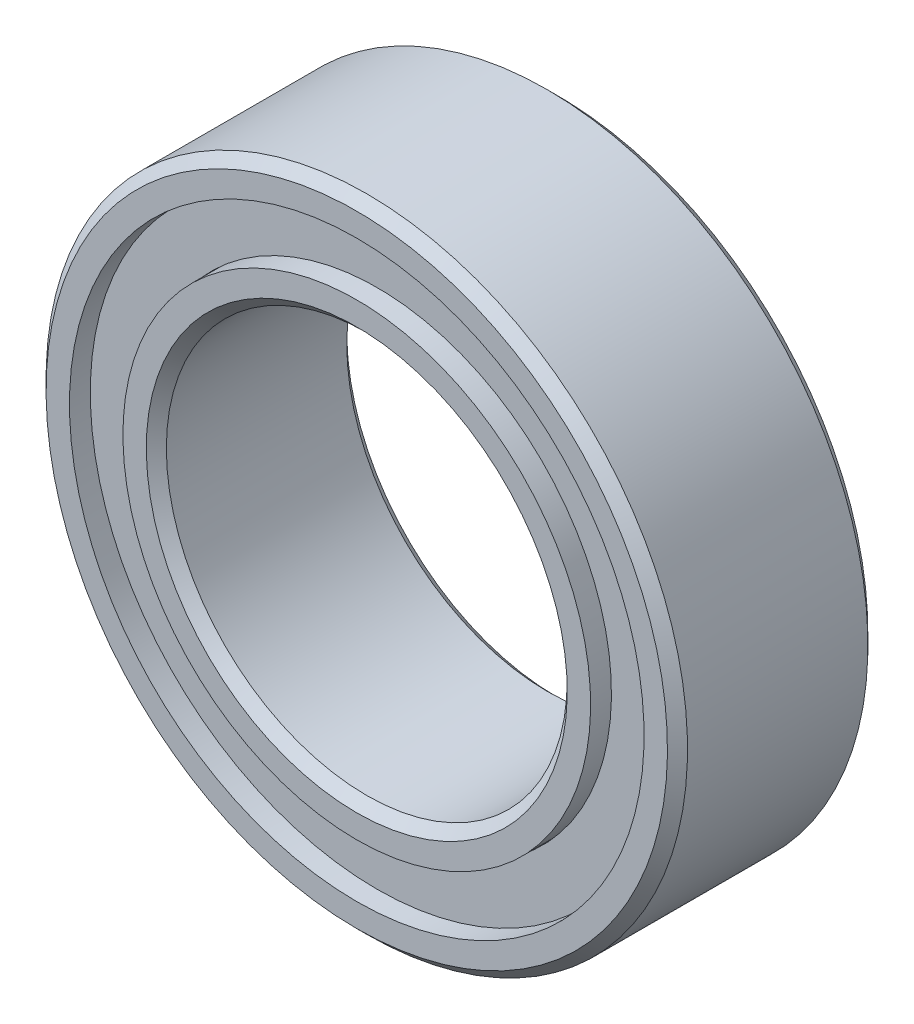
ISO-10303-21;
HEADER;
FILE_DESCRIPTION(('STEP AP214'),'2;1');
FILE_NAME('part.step','',(''),(''),'','','');
FILE_SCHEMA(('AUTOMOTIVE_DESIGN { 1 0 10303 214 1 1 1 1 }'));
ENDSEC;
DATA;
#1=APPLICATION_CONTEXT('core data for automotive mechanical design processes');
#2=APPLICATION_PROTOCOL_DEFINITION('international standard','automotive_design',2000,#1);
#3=PRODUCT_CONTEXT('',#1,'mechanical');
#4=PRODUCT('Part','Part','',(#3));
#5=PRODUCT_RELATED_PRODUCT_CATEGORY('part','',(#4));
#6=PRODUCT_DEFINITION_FORMATION('','',#4);
#7=PRODUCT_DEFINITION_CONTEXT('part definition',#1,'design');
#8=PRODUCT_DEFINITION('design','',#6,#7);
#9=PRODUCT_DEFINITION_SHAPE('','',#8);
#10=(LENGTH_UNIT() NAMED_UNIT(*) SI_UNIT(.MILLI.,.METRE.));
#11=(NAMED_UNIT(*) PLANE_ANGLE_UNIT() SI_UNIT($,.RADIAN.));
#12=(NAMED_UNIT(*) SI_UNIT($,.STERADIAN.) SOLID_ANGLE_UNIT());
#13=UNCERTAINTY_MEASURE_WITH_UNIT(LENGTH_MEASURE(1.E-05),#10,'distance_accuracy_value','');
#14=(GEOMETRIC_REPRESENTATION_CONTEXT(3) GLOBAL_UNCERTAINTY_ASSIGNED_CONTEXT((#13)) GLOBAL_UNIT_ASSIGNED_CONTEXT((#10,
#11,#12)) REPRESENTATION_CONTEXT('',''));
#15=CARTESIAN_POINT('',(0.,0.,0.));
#16=DIRECTION('',(0.,0.,1.));
#17=DIRECTION('',(1.,0.,0.));
#18=AXIS2_PLACEMENT_3D('',#15,#16,#17);
#19=CARTESIAN_POINT('',(6.04140123656884,11.5109283334918,0.));
#20=DIRECTION('',(0.,0.,1.));
#21=DIRECTION('',(0.464723172043757,0.885456025653216,0.));
#22=AXIS2_PLACEMENT_3D('',#19,#20,#21);
#23=SPHERICAL_SURFACE('',#22,2.5915341754868);
#24=CARTESIAN_POINT('',(6.04140123656884,11.5109283334918,2.5915341754868));
#25=VERTEX_POINT('',#24);
#26=VERTEX_LOOP('',#25);
#27=FACE_BOUND('',#26,.T.);
#28=ADVANCED_FACE('F52',(#27),#23,.T.);
#29=CLOSED_SHELL('',(#28));
#30=MANIFOLD_SOLID_BREP('B2',#29);
#31=CARTESIAN_POINT('',(10.6987902566174,7.38484170750515,0.));
#32=DIRECTION('',(0.,0.,1.));
#33=DIRECTION('',(0.822983865893649,0.568064746731166,0.));
#34=AXIS2_PLACEMENT_3D('',#31,#32,#33);
#35=SPHERICAL_SURFACE('',#34,2.5915341754868);
#36=CARTESIAN_POINT('',(10.6987902566174,7.38484170750515,2.5915341754868));
#37=VERTEX_POINT('',#36);
#38=VERTEX_LOOP('',#37);
#39=FACE_BOUND('',#38,.T.);
#40=ADVANCED_FACE('F75',(#39),#35,.T.);
#41=CLOSED_SHELL('',(#40));
#42=MANIFOLD_SOLID_BREP('B6',#41);
#43=CARTESIAN_POINT('',(12.9052153632747,1.56697684331934,0.));
#44=DIRECTION('',(0.,0.,1.));
#45=DIRECTION('',(0.992708874098053,0.120536680255334,0.));
#46=AXIS2_PLACEMENT_3D('',#43,#44,#45);
#47=SPHERICAL_SURFACE('',#46,2.5915341754868);
#48=CARTESIAN_POINT('',(12.9052153632747,1.56697684331934,2.5915341754868));
#49=VERTEX_POINT('',#48);
#50=VERTEX_LOOP('',#49);
#51=FACE_BOUND('',#50,.T.);
#52=ADVANCED_FACE('F95',(#51),#47,.T.);
#53=CLOSED_SHELL('',(#52));
#54=MANIFOLD_SOLID_BREP('B48',#53);
#55=CARTESIAN_POINT('',(12.1552111549104,-4.60986353155285,0.));
#56=DIRECTION('',(0.,0.,1.));
#57=DIRECTION('',(0.935016242685418,-0.354604887042527,0.));
#58=AXIS2_PLACEMENT_3D('',#55,#56,#57);
#59=SPHERICAL_SURFACE('',#58,2.5915341754868);
#60=CARTESIAN_POINT('',(12.1552111549104,-4.60986353155285,2.5915341754868));
#61=VERTEX_POINT('',#60);
#62=VERTEX_LOOP('',#61);
#63=FACE_BOUND('',#62,.T.);
#64=ADVANCED_FACE('F115',(#63),#59,.T.);
#65=CLOSED_SHELL('',(#64));
#66=MANIFOLD_SOLID_BREP('B71',#65);
#67=CARTESIAN_POINT('',(8.62059455713042,-9.73063972622424,0.));
#68=DIRECTION('',(0.,0.,1.));
#69=DIRECTION('',(0.663122658240802,-0.748510748171095,0.));
#70=AXIS2_PLACEMENT_3D('',#67,#68,#69);
#71=SPHERICAL_SURFACE('',#70,2.5915341754868);
#72=CARTESIAN_POINT('',(8.62059455713042,-9.73063972622424,2.5915341754868));
#73=VERTEX_POINT('',#72);
#74=VERTEX_LOOP('',#73);
#75=FACE_BOUND('',#74,.T.);
#76=ADVANCED_FACE('F136',(#75),#71,.T.);
#77=CLOSED_SHELL('',(#76));
#78=MANIFOLD_SOLID_BREP('B91',#77);
#79=CARTESIAN_POINT('',(3.11110363573835,-12.6222436265387,0.));
#80=DIRECTION('',(0.,0.,1.));
#81=DIRECTION('',(0.239315664287565,-0.97094181742605,0.));
#82=AXIS2_PLACEMENT_3D('',#79,#80,#81);
#83=SPHERICAL_SURFACE('',#82,2.5915341754868);
#84=CARTESIAN_POINT('',(3.11110363573835,-12.6222436265387,2.5915341754868));
#85=VERTEX_POINT('',#84);
#86=VERTEX_LOOP('',#85);
#87=FACE_BOUND('',#86,.T.);
#88=ADVANCED_FACE('F159',(#87),#83,.T.);
#89=CLOSED_SHELL('',(#88));
#90=MANIFOLD_SOLID_BREP('B111',#89);
#91=CARTESIAN_POINT('',(-3.11110363573817,-12.6222436265387,0.));
#92=DIRECTION('',(0.,0.,1.));
#93=DIRECTION('',(-0.239315664287552,-0.970941817426054,0.));
#94=AXIS2_PLACEMENT_3D('',#91,#92,#93);
#95=SPHERICAL_SURFACE('',#94,2.5915341754868);
#96=CARTESIAN_POINT('',(-3.11110363573817,-12.6222436265387,2.5915341754868));
#97=VERTEX_POINT('',#96);
#98=VERTEX_LOOP('',#97);
#99=FACE_BOUND('',#98,.T.);
#100=ADVANCED_FACE('F179',(#99),#95,.T.);
#101=CLOSED_SHELL('',(#100));
#102=MANIFOLD_SOLID_BREP('B132',#101);
#103=CARTESIAN_POINT('',(-8.62059455713028,-9.73063972622436,0.));
#104=DIRECTION('',(0.,0.,1.));
#105=DIRECTION('',(-0.663122658240791,-0.748510748171105,0.));
#106=AXIS2_PLACEMENT_3D('',#103,#104,#105);
#107=SPHERICAL_SURFACE('',#106,2.5915341754868);
#108=CARTESIAN_POINT('',(-8.62059455713028,-9.73063972622436,2.5915341754868));
#109=VERTEX_POINT('',#108);
#110=VERTEX_LOOP('',#109);
#111=FACE_BOUND('',#110,.T.);
#112=ADVANCED_FACE('F199',(#111),#107,.T.);
#113=CLOSED_SHELL('',(#112));
#114=MANIFOLD_SOLID_BREP('B155',#113);
#115=CARTESIAN_POINT('',(-12.1552111549104,-4.60986353155301,0.));
#116=DIRECTION('',(0.,0.,1.));
#117=DIRECTION('',(-0.935016242685413,-0.35460488704254,0.));
#118=AXIS2_PLACEMENT_3D('',#115,#116,#117);
#119=SPHERICAL_SURFACE('',#118,2.5915341754868);
#120=CARTESIAN_POINT('',(-12.1552111549104,-4.60986353155301,2.5915341754868));
#121=VERTEX_POINT('',#120);
#122=VERTEX_LOOP('',#121);
#123=FACE_BOUND('',#122,.T.);
#124=ADVANCED_FACE('F219',(#123),#119,.T.);
#125=CLOSED_SHELL('',(#124));
#126=MANIFOLD_SOLID_BREP('B175',#125);
#127=CARTESIAN_POINT('',(-12.9052153632747,1.56697684331916,0.));
#128=DIRECTION('',(0.,0.,1.));
#129=DIRECTION('',(-0.992708874098054,0.12053668025532,0.));
#130=AXIS2_PLACEMENT_3D('',#127,#128,#129);
#131=SPHERICAL_SURFACE('',#130,2.5915341754868);
#132=CARTESIAN_POINT('',(-12.9052153632747,1.56697684331916,2.5915341754868));
#133=VERTEX_POINT('',#132);
#134=VERTEX_LOOP('',#133);
#135=FACE_BOUND('',#134,.T.);
#136=ADVANCED_FACE('F239',(#135),#131,.T.);
#137=CLOSED_SHELL('',(#136));
#138=MANIFOLD_SOLID_BREP('B195',#137);
#139=CARTESIAN_POINT('',(-10.6987902566175,7.384841707505,0.));
#140=DIRECTION('',(0.,0.,1.));
#141=DIRECTION('',(-0.822983865893658,0.568064746731154,0.));
#142=AXIS2_PLACEMENT_3D('',#139,#140,#141);
#143=SPHERICAL_SURFACE('',#142,2.5915341754868);
#144=CARTESIAN_POINT('',(-10.6987902566175,7.384841707505,2.5915341754868));
#145=VERTEX_POINT('',#144);
#146=VERTEX_LOOP('',#145);
#147=FACE_BOUND('',#146,.T.);
#148=ADVANCED_FACE('F259',(#147),#143,.T.);
#149=CLOSED_SHELL('',(#148));
#150=MANIFOLD_SOLID_BREP('B215',#149);
#151=CARTESIAN_POINT('',(-6.041401236569,11.5109283334917,0.));
#152=DIRECTION('',(0.,0.,1.));
#153=DIRECTION('',(-0.46472317204377,0.885456025653209,0.));
#154=AXIS2_PLACEMENT_3D('',#151,#152,#153);
#155=SPHERICAL_SURFACE('',#154,2.5915341754868);
#156=CARTESIAN_POINT('',(-6.041401236569,11.5109283334917,2.5915341754868));
#157=VERTEX_POINT('',#156);
#158=VERTEX_LOOP('',#157);
#159=FACE_BOUND('',#158,.T.);
#160=ADVANCED_FACE('F280',(#159),#155,.T.);
#161=CLOSED_SHELL('',(#160));
#162=MANIFOLD_SOLID_BREP('B235',#161);
#163=CARTESIAN_POINT('',(0.,13.,0.));
#164=DIRECTION('',(0.,0.,1.));
#165=DIRECTION('',(0.,1.,0.));
#166=AXIS2_PLACEMENT_3D('',#163,#164,#165);
#167=SPHERICAL_SURFACE('',#166,2.5915341754868);
#168=CARTESIAN_POINT('',(0.,13.,2.5915341754868));
#169=VERTEX_POINT('',#168);
#170=VERTEX_LOOP('',#169);
#171=FACE_BOUND('',#170,.T.);
#172=ADVANCED_FACE('F307',(#171),#167,.T.);
#173=CLOSED_SHELL('',(#172));
#174=MANIFOLD_SOLID_BREP('B255',#173);
#175=CARTESIAN_POINT('',(0.,11.6666666666667,5.00000000000002));
#176=DIRECTION('',(0.,0.,-1.));
#177=DIRECTION('',(0.,1.,0.));
#178=AXIS2_PLACEMENT_3D('',#175,#176,#177);
#179=PLANE('',#178);
#180=CARTESIAN_POINT('',(0.,0.,5.00000000000002));
#181=DIRECTION('',(0.,0.,1.));
#182=DIRECTION('',(0.,-1.,0.));
#183=AXIS2_PLACEMENT_3D('',#180,#181,#182);
#184=CIRCLE('',#183,10.5);
#185=CARTESIAN_POINT('',(0.,-10.5,5.00000000000002));
#186=VERTEX_POINT('',#185);
#187=EDGE_CURVE('E370',#186,#186,#184,.T.);
#188=ORIENTED_EDGE('',*,*,#187,.F.);
#189=EDGE_LOOP('',(#188));
#190=FACE_BOUND('',#189,.T.);
#191=CARTESIAN_POINT('',(0.,0.,5.00000000000002));
#192=DIRECTION('',(0.,0.,1.));
#193=DIRECTION('',(0.,-1.,0.));
#194=AXIS2_PLACEMENT_3D('',#191,#192,#193);
#195=CIRCLE('',#194,11.6666666666667);
#196=CARTESIAN_POINT('',(0.,-11.6666666666667,5.00000000000002));
#197=VERTEX_POINT('',#196);
#198=EDGE_CURVE('E306',#197,#197,#195,.T.);
#199=ORIENTED_EDGE('',*,*,#198,.T.);
#200=EDGE_LOOP('',(#199));
#201=FACE_BOUND('',#200,.T.);
#202=ADVANCED_FACE('F333',(#190,#201),#179,.F.);
#203=CARTESIAN_POINT('',(0.,0.,5.00000000000002));
#204=DIRECTION('',(0.,0.,1.));
#205=DIRECTION('',(0.,-1.,0.));
#206=AXIS2_PLACEMENT_3D('',#203,#204,#205);
#207=CYLINDRICAL_SURFACE('',#206,11.6666666666667);
#208=ORIENTED_EDGE('',*,*,#198,.F.);
#209=EDGE_LOOP('',(#208));
#210=FACE_BOUND('',#209,.T.);
#211=CARTESIAN_POINT('',(0.,0.,2.22222222222222));
#212=DIRECTION('',(0.,0.,1.));
#213=DIRECTION('',(0.,-1.,0.));
#214=AXIS2_PLACEMENT_3D('',#211,#212,#213);
#215=CIRCLE('',#214,11.6666666666667);
#216=CARTESIAN_POINT('',(0.,-11.6666666666667,2.22222222222221));
#217=VERTEX_POINT('',#216);
#218=EDGE_CURVE('E340',#217,#217,#215,.T.);
#219=ORIENTED_EDGE('',*,*,#218,.T.);
#220=EDGE_LOOP('',(#219));
#221=FACE_BOUND('',#220,.T.);
#222=ADVANCED_FACE('F379',(#210,#221),#207,.T.);
#223=CARTESIAN_POINT('',(0.,0.,0.));
#224=DIRECTION('',(0.,0.,1.));
#225=DIRECTION('',(0.,-1.,0.));
#226=AXIS2_PLACEMENT_3D('',#223,#224,#225);
#227=TOROIDAL_SURFACE('',#226,13.,2.5915341754868);
#228=ORIENTED_EDGE('',*,*,#218,.F.);
#229=EDGE_LOOP('',(#228));
#230=FACE_BOUND('',#229,.T.);
#231=CARTESIAN_POINT('',(0.,0.,-2.22222222222222));
#232=DIRECTION('',(0.,0.,1.));
#233=DIRECTION('',(0.,-1.,0.));
#234=AXIS2_PLACEMENT_3D('',#231,#232,#233);
#235=CIRCLE('',#234,11.6666666666667);
#236=CARTESIAN_POINT('',(0.,-11.6666666666667,-2.22222222222222));
#237=VERTEX_POINT('',#236);
#238=EDGE_CURVE('E346',#237,#237,#235,.T.);
#239=ORIENTED_EDGE('',*,*,#238,.T.);
#240=EDGE_LOOP('',(#239));
#241=FACE_BOUND('',#240,.T.);
#242=ADVANCED_FACE('F383',(#230,#241),#227,.F.);
#243=CARTESIAN_POINT('',(0.,0.,5.00000000000002));
#244=DIRECTION('',(0.,0.,1.));
#245=DIRECTION('',(0.,-1.,0.));
#246=AXIS2_PLACEMENT_3D('',#243,#244,#245);
#247=CYLINDRICAL_SURFACE('',#246,11.6666666666667);
#248=ORIENTED_EDGE('',*,*,#238,.F.);
#249=EDGE_LOOP('',(#248));
#250=FACE_BOUND('',#249,.T.);
#251=CARTESIAN_POINT('',(0.,0.,-5.00000000000002));
#252=DIRECTION('',(0.,0.,1.));
#253=DIRECTION('',(0.,-1.,0.));
#254=AXIS2_PLACEMENT_3D('',#251,#252,#253);
#255=CIRCLE('',#254,11.6666666666667);
#256=CARTESIAN_POINT('',(0.,-11.6666666666667,-5.00000000000003));
#257=VERTEX_POINT('',#256);
#258=EDGE_CURVE('E352',#257,#257,#255,.T.);
#259=ORIENTED_EDGE('',*,*,#258,.T.);
#260=EDGE_LOOP('',(#259));
#261=FACE_BOUND('',#260,.T.);
#262=ADVANCED_FACE('F388',(#250,#261),#247,.T.);
#263=CARTESIAN_POINT('',(0.,10.5,-5.00000000000002));
#264=DIRECTION('',(0.,0.,1.));
#265=DIRECTION('',(0.,-1.,0.));
#266=AXIS2_PLACEMENT_3D('',#263,#264,#265);
#267=PLANE('',#266);
#268=ORIENTED_EDGE('',*,*,#258,.F.);
#269=EDGE_LOOP('',(#268));
#270=FACE_BOUND('',#269,.T.);
#271=CARTESIAN_POINT('',(0.,0.,-5.00000000000003));
#272=DIRECTION('',(0.,0.,1.));
#273=DIRECTION('',(0.,-1.,0.));
#274=AXIS2_PLACEMENT_3D('',#271,#272,#273);
#275=CIRCLE('',#274,10.5);
#276=CARTESIAN_POINT('',(0.,-10.5,-5.00000000000003));
#277=VERTEX_POINT('',#276);
#278=EDGE_CURVE('E358',#277,#277,#275,.T.);
#279=ORIENTED_EDGE('',*,*,#278,.T.);
#280=EDGE_LOOP('',(#279));
#281=FACE_BOUND('',#280,.T.);
#282=ADVANCED_FACE('F394',(#270,#281),#267,.F.);
#283=CARTESIAN_POINT('',(0.,0.,-4.50000000000002));
#284=DIRECTION('',(0.,0.,-1.));
#285=DIRECTION('',(0.,1.,0.));
#286=AXIS2_PLACEMENT_3D('',#283,#284,#285);
#287=CONICAL_SURFACE('',#286,10.,0.785398163397438);
#288=ORIENTED_EDGE('',*,*,#278,.F.);
#289=EDGE_LOOP('',(#288));
#290=FACE_BOUND('',#289,.T.);
#291=CARTESIAN_POINT('',(0.,0.,-4.50000000000002));
#292=DIRECTION('',(0.,0.,1.));
#293=DIRECTION('',(0.,-1.,0.));
#294=AXIS2_PLACEMENT_3D('',#291,#292,#293);
#295=CIRCLE('',#294,10.);
#296=CARTESIAN_POINT('',(0.,-10.,-4.50000000000003));
#297=VERTEX_POINT('',#296);
#298=EDGE_CURVE('E362',#297,#297,#295,.T.);
#299=ORIENTED_EDGE('',*,*,#298,.T.);
#300=EDGE_LOOP('',(#299));
#301=FACE_BOUND('',#300,.T.);
#302=ADVANCED_FACE('F398',(#290,#301),#287,.F.);
#303=CARTESIAN_POINT('',(0.,0.,5.00000000000002));
#304=DIRECTION('',(0.,0.,1.));
#305=DIRECTION('',(0.,-1.,0.));
#306=AXIS2_PLACEMENT_3D('',#303,#304,#305);
#307=CYLINDRICAL_SURFACE('',#306,10.);
#308=ORIENTED_EDGE('',*,*,#298,.F.);
#309=EDGE_LOOP('',(#308));
#310=FACE_BOUND('',#309,.T.);
#311=CARTESIAN_POINT('',(0.,0.,4.50000000000002));
#312=DIRECTION('',(0.,0.,1.));
#313=DIRECTION('',(0.,-1.,0.));
#314=AXIS2_PLACEMENT_3D('',#311,#312,#313);
#315=CIRCLE('',#314,10.);
#316=CARTESIAN_POINT('',(0.,-10.,4.50000000000002));
#317=VERTEX_POINT('',#316);
#318=EDGE_CURVE('E366',#317,#317,#315,.T.);
#319=ORIENTED_EDGE('',*,*,#318,.T.);
#320=EDGE_LOOP('',(#319));
#321=FACE_BOUND('',#320,.T.);
#322=ADVANCED_FACE('F402',(#310,#321),#307,.F.);
#323=CARTESIAN_POINT('',(0.,0.,5.00000000000002));
#324=DIRECTION('',(0.,0.,1.));
#325=DIRECTION('',(0.,-1.,0.));
#326=AXIS2_PLACEMENT_3D('',#323,#324,#325);
#327=CONICAL_SURFACE('',#326,10.5,0.785398163397459);
#328=ORIENTED_EDGE('',*,*,#318,.F.);
#329=EDGE_LOOP('',(#328));
#330=FACE_BOUND('',#329,.T.);
#331=ORIENTED_EDGE('',*,*,#187,.T.);
#332=EDGE_LOOP('',(#331));
#333=FACE_BOUND('',#332,.T.);
#334=ADVANCED_FACE('F376',(#330,#333),#327,.F.);
#335=CLOSED_SHELL('',(#202,#222,#242,#262,#282,#302,#322,#334));
#336=MANIFOLD_SOLID_BREP('B276',#335);
#337=CARTESIAN_POINT('',(0.,11.6920666666667,-3.60526708774341));
#338=DIRECTION('',(0.,0.,-1.));
#339=DIRECTION('',(0.,1.,0.));
#340=AXIS2_PLACEMENT_3D('',#337,#338,#339);
#341=PLANE('',#340);
#342=CARTESIAN_POINT('',(0.,0.,-3.60526708774342));
#343=DIRECTION('',(0.,0.,1.));
#344=DIRECTION('',(0.,-1.,0.));
#345=AXIS2_PLACEMENT_3D('',#342,#343,#344);
#346=CIRCLE('',#345,11.6920666666667);
#347=CARTESIAN_POINT('',(0.,-11.6920666666667,-3.60526708774342));
#348=VERTEX_POINT('',#347);
#349=EDGE_CURVE('E497',#348,#348,#346,.T.);
#350=ORIENTED_EDGE('',*,*,#349,.F.);
#351=EDGE_LOOP('',(#350));
#352=FACE_BOUND('',#351,.T.);
#353=CARTESIAN_POINT('',(0.,0.,-3.60526708774342));
#354=DIRECTION('',(0.,0.,1.));
#355=DIRECTION('',(0.,-1.,0.));
#356=AXIS2_PLACEMENT_3D('',#353,#354,#355);
#357=CIRCLE('',#356,14.3079333333333);
#358=CARTESIAN_POINT('',(0.,-14.3079333333333,-3.60526708774342));
#359=VERTEX_POINT('',#358);
#360=EDGE_CURVE('E332',#359,#359,#357,.T.);
#361=ORIENTED_EDGE('',*,*,#360,.T.);
#362=EDGE_LOOP('',(#361));
#363=FACE_BOUND('',#362,.T.);
#364=ADVANCED_FACE('F478',(#352,#363),#341,.F.);
#365=CARTESIAN_POINT('',(0.,0.,5.00000000000002));
#366=DIRECTION('',(0.,0.,1.));
#367=DIRECTION('',(0.,-1.,0.));
#368=AXIS2_PLACEMENT_3D('',#365,#366,#367);
#369=CYLINDRICAL_SURFACE('',#368,14.3079333333333);
#370=ORIENTED_EDGE('',*,*,#360,.F.);
#371=EDGE_LOOP('',(#370));
#372=FACE_BOUND('',#371,.T.);
#373=CARTESIAN_POINT('',(0.,0.,-3.98626708774342));
#374=DIRECTION('',(0.,0.,1.));
#375=DIRECTION('',(0.,-1.,0.));
#376=AXIS2_PLACEMENT_3D('',#373,#374,#375);
#377=CIRCLE('',#376,14.3079333333333);
#378=CARTESIAN_POINT('',(0.,-14.3079333333333,-3.98626708774342));
#379=VERTEX_POINT('',#378);
#380=EDGE_CURVE('E485',#379,#379,#377,.T.);
#381=ORIENTED_EDGE('',*,*,#380,.T.);
#382=EDGE_LOOP('',(#381));
#383=FACE_BOUND('',#382,.T.);
#384=ADVANCED_FACE('F508',(#372,#383),#369,.T.);
#385=CARTESIAN_POINT('',(0.,11.6920666666667,-3.98626708774342));
#386=DIRECTION('',(0.,0.,1.));
#387=DIRECTION('',(0.,-1.,0.));
#388=AXIS2_PLACEMENT_3D('',#385,#386,#387);
#389=PLANE('',#388);
#390=ORIENTED_EDGE('',*,*,#380,.F.);
#391=EDGE_LOOP('',(#390));
#392=FACE_BOUND('',#391,.T.);
#393=CARTESIAN_POINT('',(0.,0.,-3.98626708774342));
#394=DIRECTION('',(0.,0.,1.));
#395=DIRECTION('',(0.,-1.,0.));
#396=AXIS2_PLACEMENT_3D('',#393,#394,#395);
#397=CIRCLE('',#396,11.6920666666667);
#398=CARTESIAN_POINT('',(0.,-11.6920666666667,-3.98626708774342));
#399=VERTEX_POINT('',#398);
#400=EDGE_CURVE('E491',#399,#399,#397,.T.);
#401=ORIENTED_EDGE('',*,*,#400,.T.);
#402=EDGE_LOOP('',(#401));
#403=FACE_BOUND('',#402,.T.);
#404=ADVANCED_FACE('F512',(#392,#403),#389,.F.);
#405=CARTESIAN_POINT('',(0.,0.,5.00000000000002));
#406=DIRECTION('',(0.,0.,1.));
#407=DIRECTION('',(0.,-1.,0.));
#408=AXIS2_PLACEMENT_3D('',#405,#406,#407);
#409=CYLINDRICAL_SURFACE('',#408,11.6920666666667);
#410=ORIENTED_EDGE('',*,*,#400,.F.);
#411=EDGE_LOOP('',(#410));
#412=FACE_BOUND('',#411,.T.);
#413=ORIENTED_EDGE('',*,*,#349,.T.);
#414=EDGE_LOOP('',(#413));
#415=FACE_BOUND('',#414,.T.);
#416=ADVANCED_FACE('F505',(#412,#415),#409,.F.);
#417=CLOSED_SHELL('',(#364,#384,#404,#416));
#418=MANIFOLD_SOLID_BREP('B301',#417);
#419=CARTESIAN_POINT('',(0.,11.6920666666667,3.9862670877434));
#420=DIRECTION('',(0.,0.,-1.));
#421=DIRECTION('',(0.,1.,0.));
#422=AXIS2_PLACEMENT_3D('',#419,#420,#421);
#423=PLANE('',#422);
#424=CARTESIAN_POINT('',(0.,0.,3.9862670877434));
#425=DIRECTION('',(0.,0.,1.));
#426=DIRECTION('',(0.,-1.,0.));
#427=AXIS2_PLACEMENT_3D('',#424,#425,#426);
#428=CIRCLE('',#427,11.6920666666667);
#429=CARTESIAN_POINT('',(0.,-11.6920666666667,3.9862670877434));
#430=VERTEX_POINT('',#429);
#431=EDGE_CURVE('E477',#430,#430,#428,.T.);
#432=ORIENTED_EDGE('',*,*,#431,.F.);
#433=EDGE_LOOP('',(#432));
#434=FACE_BOUND('',#433,.T.);
#435=CARTESIAN_POINT('',(0.,0.,3.9862670877434));
#436=DIRECTION('',(0.,0.,1.));
#437=DIRECTION('',(0.,-1.,0.));
#438=AXIS2_PLACEMENT_3D('',#435,#436,#437);
#439=CIRCLE('',#438,14.3079333333333);
#440=CARTESIAN_POINT('',(0.,-14.3079333333333,3.9862670877434));
#441=VERTEX_POINT('',#440);
#442=EDGE_CURVE('E577',#441,#441,#439,.T.);
#443=ORIENTED_EDGE('',*,*,#442,.T.);
#444=EDGE_LOOP('',(#443));
#445=FACE_BOUND('',#444,.T.);
#446=ADVANCED_FACE('F558',(#434,#445),#423,.F.);
#447=CARTESIAN_POINT('',(0.,0.,5.00000000000002));
#448=DIRECTION('',(0.,0.,1.));
#449=DIRECTION('',(0.,-1.,0.));
#450=AXIS2_PLACEMENT_3D('',#447,#448,#449);
#451=CYLINDRICAL_SURFACE('',#450,11.6920666666667);
#452=CARTESIAN_POINT('',(0.,0.,3.6052670877434));
#453=DIRECTION('',(0.,0.,1.));
#454=DIRECTION('',(0.,-1.,0.));
#455=AXIS2_PLACEMENT_3D('',#452,#453,#454);
#456=CIRCLE('',#455,11.6920666666667);
#457=CARTESIAN_POINT('',(0.,-11.6920666666667,3.6052670877434));
#458=VERTEX_POINT('',#457);
#459=EDGE_CURVE('E565',#458,#458,#456,.T.);
#460=ORIENTED_EDGE('',*,*,#459,.F.);
#461=EDGE_LOOP('',(#460));
#462=FACE_BOUND('',#461,.T.);
#463=ORIENTED_EDGE('',*,*,#431,.T.);
#464=EDGE_LOOP('',(#463));
#465=FACE_BOUND('',#464,.T.);
#466=ADVANCED_FACE('F594',(#462,#465),#451,.F.);
#467=CARTESIAN_POINT('',(0.,11.6920666666667,3.6052670877434));
#468=DIRECTION('',(0.,0.,1.));
#469=DIRECTION('',(0.,-1.,0.));
#470=AXIS2_PLACEMENT_3D('',#467,#468,#469);
#471=PLANE('',#470);
#472=CARTESIAN_POINT('',(0.,0.,3.6052670877434));
#473=DIRECTION('',(0.,0.,1.));
#474=DIRECTION('',(0.,-1.,0.));
#475=AXIS2_PLACEMENT_3D('',#472,#473,#474);
#476=CIRCLE('',#475,14.3079333333333);
#477=CARTESIAN_POINT('',(0.,-14.3079333333333,3.6052670877434));
#478=VERTEX_POINT('',#477);
#479=EDGE_CURVE('E571',#478,#478,#476,.T.);
#480=ORIENTED_EDGE('',*,*,#479,.F.);
#481=EDGE_LOOP('',(#480));
#482=FACE_BOUND('',#481,.T.);
#483=ORIENTED_EDGE('',*,*,#459,.T.);
#484=EDGE_LOOP('',(#483));
#485=FACE_BOUND('',#484,.T.);
#486=ADVANCED_FACE('F589',(#482,#485),#471,.F.);
#487=CARTESIAN_POINT('',(0.,0.,5.00000000000002));
#488=DIRECTION('',(0.,0.,1.));
#489=DIRECTION('',(0.,-1.,0.));
#490=AXIS2_PLACEMENT_3D('',#487,#488,#489);
#491=CYLINDRICAL_SURFACE('',#490,14.3079333333333);
#492=ORIENTED_EDGE('',*,*,#442,.F.);
#493=EDGE_LOOP('',(#492));
#494=FACE_BOUND('',#493,.T.);
#495=ORIENTED_EDGE('',*,*,#479,.T.);
#496=EDGE_LOOP('',(#495));
#497=FACE_BOUND('',#496,.T.);
#498=ADVANCED_FACE('F586',(#494,#497),#491,.T.);
#499=CLOSED_SHELL('',(#446,#466,#486,#498));
#500=MANIFOLD_SOLID_BREP('B327',#499);
#501=CARTESIAN_POINT('',(0.,0.,4.50000000000002));
#502=DIRECTION('',(0.,0.,-1.));
#503=DIRECTION('',(0.,1.,0.));
#504=AXIS2_PLACEMENT_3D('',#501,#502,#503);
#505=CONICAL_SURFACE('',#504,16.,0.785398163397448);
#506=CARTESIAN_POINT('',(0.,0.,5.00000000000002));
#507=DIRECTION('',(0.,0.,1.));
#508=DIRECTION('',(0.,-1.,0.));
#509=AXIS2_PLACEMENT_3D('',#506,#507,#508);
#510=CIRCLE('',#509,15.5);
#511=CARTESIAN_POINT('',(0.,-15.5,5.00000000000002));
#512=VERTEX_POINT('',#511);
#513=EDGE_CURVE('E672',#512,#512,#510,.T.);
#514=ORIENTED_EDGE('',*,*,#513,.F.);
#515=EDGE_LOOP('',(#514));
#516=FACE_BOUND('',#515,.T.);
#517=CARTESIAN_POINT('',(0.,0.,4.50000000000002));
#518=DIRECTION('',(0.,0.,1.));
#519=DIRECTION('',(0.,-1.,0.));
#520=AXIS2_PLACEMENT_3D('',#517,#518,#519);
#521=CIRCLE('',#520,16.);
#522=CARTESIAN_POINT('',(0.,-16.,4.50000000000002));
#523=VERTEX_POINT('',#522);
#524=EDGE_CURVE('E557',#523,#523,#521,.T.);
#525=ORIENTED_EDGE('',*,*,#524,.T.);
#526=EDGE_LOOP('',(#525));
#527=FACE_BOUND('',#526,.T.);
#528=ADVANCED_FACE('F635',(#516,#527),#505,.T.);
#529=CARTESIAN_POINT('',(0.,0.,5.00000000000002));
#530=DIRECTION('',(0.,0.,1.));
#531=DIRECTION('',(0.,-1.,0.));
#532=AXIS2_PLACEMENT_3D('',#529,#530,#531);
#533=CYLINDRICAL_SURFACE('',#532,16.);
#534=ORIENTED_EDGE('',*,*,#524,.F.);
#535=EDGE_LOOP('',(#534));
#536=FACE_BOUND('',#535,.T.);
#537=CARTESIAN_POINT('',(0.,0.,-4.50000000000002));
#538=DIRECTION('',(0.,0.,1.));
#539=DIRECTION('',(0.,-1.,0.));
#540=AXIS2_PLACEMENT_3D('',#537,#538,#539);
#541=CIRCLE('',#540,16.);
#542=CARTESIAN_POINT('',(0.,-16.,-4.50000000000003));
#543=VERTEX_POINT('',#542);
#544=EDGE_CURVE('E642',#543,#543,#541,.T.);
#545=ORIENTED_EDGE('',*,*,#544,.T.);
#546=EDGE_LOOP('',(#545));
#547=FACE_BOUND('',#546,.T.);
#548=ADVANCED_FACE('F681',(#536,#547),#533,.T.);
#549=CARTESIAN_POINT('',(0.,0.,-5.00000000000002));
#550=DIRECTION('',(0.,0.,1.));
#551=DIRECTION('',(0.,-1.,0.));
#552=AXIS2_PLACEMENT_3D('',#549,#550,#551);
#553=CONICAL_SURFACE('',#552,15.5,0.78539816339745);
#554=ORIENTED_EDGE('',*,*,#544,.F.);
#555=EDGE_LOOP('',(#554));
#556=FACE_BOUND('',#555,.T.);
#557=CARTESIAN_POINT('',(0.,0.,-5.00000000000002));
#558=DIRECTION('',(0.,0.,1.));
#559=DIRECTION('',(0.,-1.,0.));
#560=AXIS2_PLACEMENT_3D('',#557,#558,#559);
#561=CIRCLE('',#560,15.5);
#562=CARTESIAN_POINT('',(0.,-15.5,-5.00000000000003));
#563=VERTEX_POINT('',#562);
#564=EDGE_CURVE('E648',#563,#563,#561,.T.);
#565=ORIENTED_EDGE('',*,*,#564,.T.);
#566=EDGE_LOOP('',(#565));
#567=FACE_BOUND('',#566,.T.);
#568=ADVANCED_FACE('F685',(#556,#567),#553,.T.);
#569=CARTESIAN_POINT('',(0.,15.5,-5.00000000000002));
#570=DIRECTION('',(0.,0.,1.));
#571=DIRECTION('',(0.,-1.,0.));
#572=AXIS2_PLACEMENT_3D('',#569,#570,#571);
#573=PLANE('',#572);
#574=ORIENTED_EDGE('',*,*,#564,.F.);
#575=EDGE_LOOP('',(#574));
#576=FACE_BOUND('',#575,.T.);
#577=CARTESIAN_POINT('',(0.,0.,-5.00000000000002));
#578=DIRECTION('',(0.,0.,1.));
#579=DIRECTION('',(0.,-1.,0.));
#580=AXIS2_PLACEMENT_3D('',#577,#578,#579);
#581=CIRCLE('',#580,14.3333333333333);
#582=CARTESIAN_POINT('',(0.,-14.3333333333333,-5.00000000000003));
#583=VERTEX_POINT('',#582);
#584=EDGE_CURVE('E654',#583,#583,#581,.T.);
#585=ORIENTED_EDGE('',*,*,#584,.T.);
#586=EDGE_LOOP('',(#585));
#587=FACE_BOUND('',#586,.T.);
#588=ADVANCED_FACE('F690',(#576,#587),#573,.F.);
#589=CARTESIAN_POINT('',(0.,0.,5.00000000000002));
#590=DIRECTION('',(0.,0.,1.));
#591=DIRECTION('',(0.,-1.,0.));
#592=AXIS2_PLACEMENT_3D('',#589,#590,#591);
#593=CYLINDRICAL_SURFACE('',#592,14.3333333333333);
#594=ORIENTED_EDGE('',*,*,#584,.F.);
#595=EDGE_LOOP('',(#594));
#596=FACE_BOUND('',#595,.T.);
#597=CARTESIAN_POINT('',(0.,0.,-2.22222222222223));
#598=DIRECTION('',(0.,0.,1.));
#599=DIRECTION('',(0.,-1.,0.));
#600=AXIS2_PLACEMENT_3D('',#597,#598,#599);
#601=CIRCLE('',#600,14.3333333333333);
#602=CARTESIAN_POINT('',(0.,-14.3333333333333,-2.22222222222223));
#603=VERTEX_POINT('',#602);
#604=EDGE_CURVE('E660',#603,#603,#601,.T.);
#605=ORIENTED_EDGE('',*,*,#604,.T.);
#606=EDGE_LOOP('',(#605));
#607=FACE_BOUND('',#606,.T.);
#608=ADVANCED_FACE('F696',(#596,#607),#593,.F.);
#609=CARTESIAN_POINT('',(0.,0.,0.));
#610=DIRECTION('',(0.,0.,1.));
#611=DIRECTION('',(0.,-1.,0.));
#612=AXIS2_PLACEMENT_3D('',#609,#610,#611);
#613=TOROIDAL_SURFACE('',#612,13.,2.5915341754868);
#614=ORIENTED_EDGE('',*,*,#604,.F.);
#615=EDGE_LOOP('',(#614));
#616=FACE_BOUND('',#615,.T.);
#617=CARTESIAN_POINT('',(0.,0.,2.22222222222222));
#618=DIRECTION('',(0.,0.,1.));
#619=DIRECTION('',(0.,-1.,0.));
#620=AXIS2_PLACEMENT_3D('',#617,#618,#619);
#621=CIRCLE('',#620,14.3333333333333);
#622=CARTESIAN_POINT('',(0.,-14.3333333333333,2.22222222222221));
#623=VERTEX_POINT('',#622);
#624=EDGE_CURVE('E664',#623,#623,#621,.T.);
#625=ORIENTED_EDGE('',*,*,#624,.T.);
#626=EDGE_LOOP('',(#625));
#627=FACE_BOUND('',#626,.T.);
#628=ADVANCED_FACE('F700',(#616,#627),#613,.F.);
#629=CARTESIAN_POINT('',(0.,0.,5.00000000000002));
#630=DIRECTION('',(0.,0.,1.));
#631=DIRECTION('',(0.,-1.,0.));
#632=AXIS2_PLACEMENT_3D('',#629,#630,#631);
#633=CYLINDRICAL_SURFACE('',#632,14.3333333333333);
#634=ORIENTED_EDGE('',*,*,#624,.F.);
#635=EDGE_LOOP('',(#634));
#636=FACE_BOUND('',#635,.T.);
#637=CARTESIAN_POINT('',(0.,0.,5.00000000000001));
#638=DIRECTION('',(0.,0.,1.));
#639=DIRECTION('',(0.,-1.,0.));
#640=AXIS2_PLACEMENT_3D('',#637,#638,#639);
#641=CIRCLE('',#640,14.3333333333333);
#642=CARTESIAN_POINT('',(0.,-14.3333333333333,5.00000000000001));
#643=VERTEX_POINT('',#642);
#644=EDGE_CURVE('E668',#643,#643,#641,.T.);
#645=ORIENTED_EDGE('',*,*,#644,.T.);
#646=EDGE_LOOP('',(#645));
#647=FACE_BOUND('',#646,.T.);
#648=ADVANCED_FACE('F704',(#636,#647),#633,.F.);
#649=CARTESIAN_POINT('',(0.,15.5,5.00000000000002));
#650=DIRECTION('',(0.,0.,-1.));
#651=DIRECTION('',(0.,1.,0.));
#652=AXIS2_PLACEMENT_3D('',#649,#650,#651);
#653=PLANE('',#652);
#654=ORIENTED_EDGE('',*,*,#644,.F.);
#655=EDGE_LOOP('',(#654));
#656=FACE_BOUND('',#655,.T.);
#657=ORIENTED_EDGE('',*,*,#513,.T.);
#658=EDGE_LOOP('',(#657));
#659=FACE_BOUND('',#658,.T.);
#660=ADVANCED_FACE('F678',(#656,#659),#653,.F.);
#661=CLOSED_SHELL('',(#528,#548,#568,#588,#608,#628,#648,#660));
#662=MANIFOLD_SOLID_BREP('B472',#661);
#663=ADVANCED_BREP_SHAPE_REPRESENTATION('',(#18,#30,#42,#54,#66,#78,#90,#102,#114,#126,#138,
#150,#162,#174,#336,#418,#500,#662),#14);
#664=SHAPE_DEFINITION_REPRESENTATION(#9,#663);
ENDSEC;
END-ISO-10303-21;
